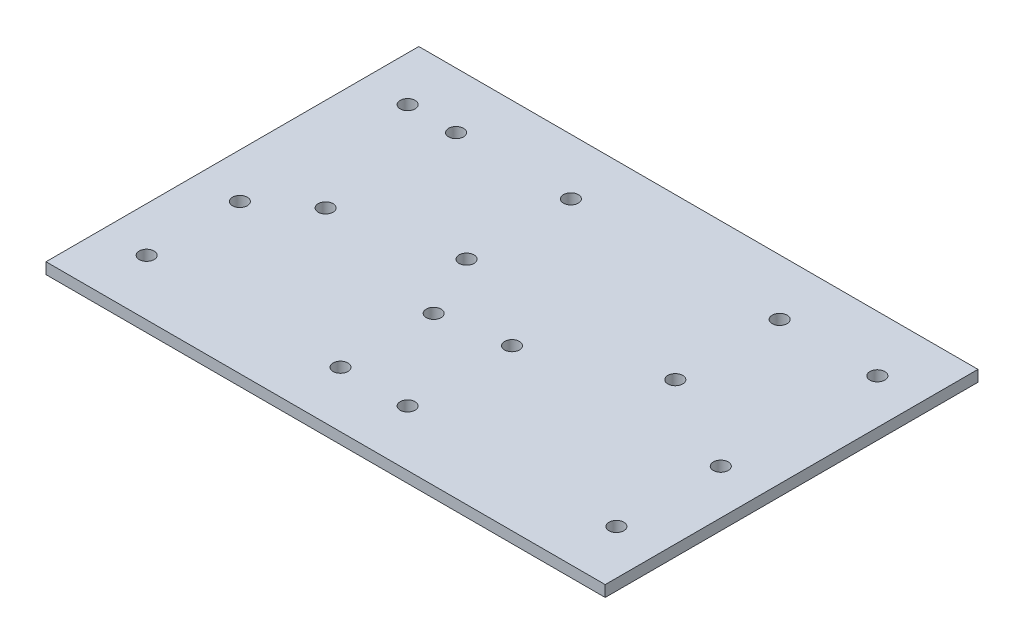
ISO-10303-21;
HEADER;
FILE_DESCRIPTION(('STEP AP214'),'2;1');
FILE_NAME('part.step','',(''),(''),'','','');
FILE_SCHEMA(('AUTOMOTIVE_DESIGN { 1 0 10303 214 1 1 1 1 }'));
ENDSEC;
DATA;
#1=APPLICATION_CONTEXT('core data for automotive mechanical design processes');
#2=APPLICATION_PROTOCOL_DEFINITION('international standard','automotive_design',2000,#1);
#3=PRODUCT_CONTEXT('',#1,'mechanical');
#4=PRODUCT('Part','Part','',(#3));
#5=PRODUCT_RELATED_PRODUCT_CATEGORY('part','',(#4));
#6=PRODUCT_DEFINITION_FORMATION('','',#4);
#7=PRODUCT_DEFINITION_CONTEXT('part definition',#1,'design');
#8=PRODUCT_DEFINITION('design','',#6,#7);
#9=PRODUCT_DEFINITION_SHAPE('','',#8);
#10=(LENGTH_UNIT() NAMED_UNIT(*) SI_UNIT(.MILLI.,.METRE.));
#11=(NAMED_UNIT(*) PLANE_ANGLE_UNIT() SI_UNIT($,.RADIAN.));
#12=(NAMED_UNIT(*) SI_UNIT($,.STERADIAN.) SOLID_ANGLE_UNIT());
#13=UNCERTAINTY_MEASURE_WITH_UNIT(LENGTH_MEASURE(1.E-05),#10,'distance_accuracy_value','');
#14=(GEOMETRIC_REPRESENTATION_CONTEXT(3) GLOBAL_UNCERTAINTY_ASSIGNED_CONTEXT((#13)) GLOBAL_UNIT_ASSIGNED_CONTEXT((#10,
#11,#12)) REPRESENTATION_CONTEXT('',''));
#15=CARTESIAN_POINT('',(0.,0.,0.));
#16=DIRECTION('',(0.,0.,1.));
#17=DIRECTION('',(1.,0.,0.));
#18=AXIS2_PLACEMENT_3D('',#15,#16,#17);
#19=CARTESIAN_POINT('',(0.,3.,0.));
#20=DIRECTION('',(0.,1.,0.));
#21=DIRECTION('',(0.,0.,1.));
#22=AXIS2_PLACEMENT_3D('',#19,#20,#21);
#23=PLANE('',#22);
#24=CARTESIAN_POINT('',(52.,3.,72.5027201008601));
#25=DIRECTION('',(0.,1.,0.));
#26=DIRECTION('',(0.,0.,1.));
#27=AXIS2_PLACEMENT_3D('',#24,#25,#26);
#28=CIRCLE('',#27,2.);
#29=CARTESIAN_POINT('',(52.,3.,74.5027201008601));
#30=VERTEX_POINT('',#29);
#31=EDGE_CURVE('E167',#30,#30,#28,.T.);
#32=ORIENTED_EDGE('',*,*,#31,.F.);
#33=EDGE_LOOP('',(#32));
#34=FACE_BOUND('',#33,.T.);
#35=CARTESIAN_POINT('',(43.8002325240294,3.,2.50272010086011));
#36=DIRECTION('',(0.,1.,0.));
#37=DIRECTION('',(0.,0.,1.));
#38=AXIS2_PLACEMENT_3D('',#35,#36,#37);
#39=CIRCLE('',#38,2.);
#40=CARTESIAN_POINT('',(43.8002325240294,3.,4.50272010086011));
#41=VERTEX_POINT('',#40);
#42=EDGE_CURVE('E160',#41,#41,#39,.T.);
#43=ORIENTED_EDGE('',*,*,#42,.F.);
#44=EDGE_LOOP('',(#43));
#45=FACE_BOUND('',#44,.T.);
#46=CARTESIAN_POINT('',(43.8002325240294,3.,30.5027201008601));
#47=DIRECTION('',(0.,1.,0.));
#48=DIRECTION('',(0.,0.,1.));
#49=AXIS2_PLACEMENT_3D('',#46,#47,#48);
#50=CIRCLE('',#49,2.);
#51=CARTESIAN_POINT('',(43.8002325240294,3.,32.5027201008601));
#52=VERTEX_POINT('',#51);
#53=EDGE_CURVE('E179',#52,#52,#50,.T.);
#54=ORIENTED_EDGE('',*,*,#53,.F.);
#55=EDGE_LOOP('',(#54));
#56=FACE_BOUND('',#55,.T.);
#57=CARTESIAN_POINT('',(99.8002325240294,3.,2.50272010086011));
#58=DIRECTION('',(0.,1.,0.));
#59=DIRECTION('',(0.,0.,1.));
#60=AXIS2_PLACEMENT_3D('',#57,#58,#59);
#61=CIRCLE('',#60,2.);
#62=CARTESIAN_POINT('',(99.8002325240294,3.,4.5027201008601));
#63=VERTEX_POINT('',#62);
#64=EDGE_CURVE('E172',#63,#63,#61,.T.);
#65=ORIENTED_EDGE('',*,*,#64,.F.);
#66=EDGE_LOOP('',(#65));
#67=FACE_BOUND('',#66,.T.);
#68=CARTESIAN_POINT('',(13.,3.,37.5027201008601));
#69=DIRECTION('',(0.,1.,0.));
#70=DIRECTION('',(0.,0.,1.));
#71=AXIS2_PLACEMENT_3D('',#68,#69,#70);
#72=CIRCLE('',#71,2.);
#73=CARTESIAN_POINT('',(13.,3.,39.5027201008601));
#74=VERTEX_POINT('',#73);
#75=EDGE_CURVE('E149',#74,#74,#72,.T.);
#76=ORIENTED_EDGE('',*,*,#75,.F.);
#77=EDGE_LOOP('',(#76));
#78=FACE_BOUND('',#77,.T.);
#79=CARTESIAN_POINT('',(0.,3.,47.5027201008601));
#80=DIRECTION('',(0.,1.,0.));
#81=DIRECTION('',(0.,0.,1.));
#82=AXIS2_PLACEMENT_3D('',#79,#80,#81);
#83=CIRCLE('',#82,2.);
#84=CARTESIAN_POINT('',(0.,3.,49.5027201008601));
#85=VERTEX_POINT('',#84);
#86=EDGE_CURVE('E142',#85,#85,#83,.T.);
#87=ORIENTED_EDGE('',*,*,#86,.F.);
#88=EDGE_LOOP('',(#87));
#89=FACE_BOUND('',#88,.T.);
#90=CARTESIAN_POINT('',(52.,3.,47.5027201008601));
#91=DIRECTION('',(0.,1.,0.));
#92=DIRECTION('',(0.,0.,1.));
#93=AXIS2_PLACEMENT_3D('',#90,#91,#92);
#94=CIRCLE('',#93,2.);
#95=CARTESIAN_POINT('',(52.,3.,49.5027201008601));
#96=VERTEX_POINT('',#95);
#97=EDGE_CURVE('E154',#96,#96,#94,.T.);
#98=ORIENTED_EDGE('',*,*,#97,.F.);
#99=EDGE_LOOP('',(#98));
#100=FACE_BOUND('',#99,.T.);
#101=CARTESIAN_POINT('',(126.,3.,44.5027201008601));
#102=DIRECTION('',(0.,1.,0.));
#103=DIRECTION('',(0.,0.,1.));
#104=AXIS2_PLACEMENT_3D('',#101,#102,#103);
#105=CIRCLE('',#104,2.);
#106=CARTESIAN_POINT('',(126.,3.,46.5027201008601));
#107=VERTEX_POINT('',#106);
#108=EDGE_CURVE('E196',#107,#107,#105,.T.);
#109=ORIENTED_EDGE('',*,*,#108,.F.);
#110=EDGE_LOOP('',(#109));
#111=FACE_BOUND('',#110,.T.);
#112=CARTESIAN_POINT('',(70.,3.,72.5027201008601));
#113=DIRECTION('',(0.,1.,0.));
#114=DIRECTION('',(0.,0.,1.));
#115=AXIS2_PLACEMENT_3D('',#112,#113,#114);
#116=CIRCLE('',#115,2.);
#117=CARTESIAN_POINT('',(70.,3.,74.5027201008601));
#118=VERTEX_POINT('',#117);
#119=EDGE_CURVE('E202',#118,#118,#116,.T.);
#120=ORIENTED_EDGE('',*,*,#119,.F.);
#121=EDGE_LOOP('',(#120));
#122=FACE_BOUND('',#121,.T.);
#123=CARTESIAN_POINT('',(70.,3.,44.5027201008601));
#124=DIRECTION('',(0.,1.,0.));
#125=DIRECTION('',(0.,0.,1.));
#126=AXIS2_PLACEMENT_3D('',#123,#124,#125);
#127=CIRCLE('',#126,2.);
#128=CARTESIAN_POINT('',(70.,3.,46.5027201008601));
#129=VERTEX_POINT('',#128);
#130=EDGE_CURVE('E184',#129,#129,#127,.T.);
#131=ORIENTED_EDGE('',*,*,#130,.F.);
#132=EDGE_LOOP('',(#131));
#133=FACE_BOUND('',#132,.T.);
#134=CARTESIAN_POINT('',(99.8002325240294,3.,30.5027201008601));
#135=DIRECTION('',(0.,1.,0.));
#136=DIRECTION('',(0.,0.,1.));
#137=AXIS2_PLACEMENT_3D('',#134,#135,#136);
#138=CIRCLE('',#137,2.);
#139=CARTESIAN_POINT('',(99.8002325240294,3.,32.5027201008601));
#140=VERTEX_POINT('',#139);
#141=EDGE_CURVE('E191',#140,#140,#138,.T.);
#142=ORIENTED_EDGE('',*,*,#141,.F.);
#143=EDGE_LOOP('',(#142));
#144=FACE_BOUND('',#143,.T.);
#145=CARTESIAN_POINT('',(13.,3.,2.50272010086011));
#146=DIRECTION('',(0.,1.,0.));
#147=DIRECTION('',(0.,0.,1.));
#148=AXIS2_PLACEMENT_3D('',#145,#146,#147);
#149=CIRCLE('',#148,2.);
#150=CARTESIAN_POINT('',(13.,3.,4.50272010086011));
#151=VERTEX_POINT('',#150);
#152=EDGE_CURVE('E136',#151,#151,#149,.T.);
#153=ORIENTED_EDGE('',*,*,#152,.F.);
#154=EDGE_LOOP('',(#153));
#155=FACE_BOUND('',#154,.T.);
#156=CARTESIAN_POINT('',(0.,3.,72.5027201008601));
#157=DIRECTION('',(0.,1.,0.));
#158=DIRECTION('',(0.,0.,1.));
#159=AXIS2_PLACEMENT_3D('',#156,#157,#158);
#160=CIRCLE('',#159,2.);
#161=CARTESIAN_POINT('',(0.,3.,74.5027201008601));
#162=VERTEX_POINT('',#161);
#163=EDGE_CURVE('E121',#162,#162,#160,.T.);
#164=ORIENTED_EDGE('',*,*,#163,.F.);
#165=EDGE_LOOP('',(#164));
#166=FACE_BOUND('',#165,.T.);
#167=CARTESIAN_POINT('',(0.,3.,2.50272010086011));
#168=DIRECTION('',(0.,1.,0.));
#169=DIRECTION('',(0.,0.,1.));
#170=AXIS2_PLACEMENT_3D('',#167,#168,#169);
#171=CIRCLE('',#170,2.);
#172=CARTESIAN_POINT('',(0.,3.,4.50272010086011));
#173=VERTEX_POINT('',#172);
#174=EDGE_CURVE('E100',#173,#173,#171,.T.);
#175=ORIENTED_EDGE('',*,*,#174,.F.);
#176=EDGE_LOOP('',(#175));
#177=FACE_BOUND('',#176,.T.);
#178=DIRECTION('',(0.,0.,1.));
#179=VECTOR('',#178,1.);
#180=CARTESIAN_POINT('',(-12.,3.,-12.4972798991399));
#181=LINE('',#180,#179);
#182=CARTESIAN_POINT('',(-12.,3.,-12.4972798991399));
#183=VERTEX_POINT('',#182);
#184=CARTESIAN_POINT('',(-12.,3.,87.5027201008601));
#185=VERTEX_POINT('',#184);
#186=EDGE_CURVE('E85',#183,#185,#181,.T.);
#187=ORIENTED_EDGE('',*,*,#186,.T.);
#188=DIRECTION('',(1.,0.,0.));
#189=VECTOR('',#188,1.);
#190=CARTESIAN_POINT('',(-12.,3.,87.5027201008601));
#191=LINE('',#190,#189);
#192=CARTESIAN_POINT('',(138.,3.,87.5027201008601));
#193=VERTEX_POINT('',#192);
#194=EDGE_CURVE('E80',#185,#193,#191,.T.);
#195=ORIENTED_EDGE('',*,*,#194,.T.);
#196=DIRECTION('',(0.,0.,-1.));
#197=VECTOR('',#196,1.);
#198=CARTESIAN_POINT('',(138.,3.,-12.4972798991399));
#199=LINE('',#198,#197);
#200=CARTESIAN_POINT('',(138.,3.,-12.4972798991399));
#201=VERTEX_POINT('',#200);
#202=EDGE_CURVE('E83',#193,#201,#199,.T.);
#203=ORIENTED_EDGE('',*,*,#202,.T.);
#204=DIRECTION('',(-1.,0.,0.));
#205=VECTOR('',#204,1.);
#206=CARTESIAN_POINT('',(-12.,3.,-12.4972798991399));
#207=LINE('',#206,#205);
#208=EDGE_CURVE('E50',#201,#183,#207,.T.);
#209=ORIENTED_EDGE('',*,*,#208,.T.);
#210=EDGE_LOOP('',(#187,#195,#203,#209));
#211=FACE_BOUND('',#210,.T.);
#212=CARTESIAN_POINT('',(126.,3.,2.50272010086011));
#213=DIRECTION('',(0.,1.,0.));
#214=DIRECTION('',(0.,0.,1.));
#215=AXIS2_PLACEMENT_3D('',#212,#213,#214);
#216=CIRCLE('',#215,2.);
#217=CARTESIAN_POINT('',(126.,3.,4.5027201008601));
#218=VERTEX_POINT('',#217);
#219=EDGE_CURVE('E115',#218,#218,#216,.T.);
#220=ORIENTED_EDGE('',*,*,#219,.F.);
#221=EDGE_LOOP('',(#220));
#222=FACE_BOUND('',#221,.T.);
#223=CARTESIAN_POINT('',(126.,3.,72.5027201008601));
#224=DIRECTION('',(0.,1.,0.));
#225=DIRECTION('',(0.,0.,1.));
#226=AXIS2_PLACEMENT_3D('',#223,#224,#225);
#227=CIRCLE('',#226,2.);
#228=CARTESIAN_POINT('',(126.,3.,74.5027201008601));
#229=VERTEX_POINT('',#228);
#230=EDGE_CURVE('E127',#229,#229,#227,.T.);
#231=ORIENTED_EDGE('',*,*,#230,.F.);
#232=EDGE_LOOP('',(#231));
#233=FACE_BOUND('',#232,.T.);
#234=ADVANCED_FACE('F33',(#34,#45,#56,#67,#78,#89,#100,#111,#122,#133,#144,#155,#166,#177,#211,
#222,#233),#23,.T.);
#235=CARTESIAN_POINT('',(0.,0.,0.));
#236=DIRECTION('',(0.,1.,0.));
#237=DIRECTION('',(0.,0.,1.));
#238=AXIS2_PLACEMENT_3D('',#235,#236,#237);
#239=PLANE('',#238);
#240=CARTESIAN_POINT('',(52.,0.,72.5027201008601));
#241=DIRECTION('',(0.,1.,0.));
#242=DIRECTION('',(0.,0.,1.));
#243=AXIS2_PLACEMENT_3D('',#240,#241,#242);
#244=CIRCLE('',#243,2.);
#245=CARTESIAN_POINT('',(52.,0.,74.5027201008601));
#246=VERTEX_POINT('',#245);
#247=EDGE_CURVE('E157',#246,#246,#244,.T.);
#248=ORIENTED_EDGE('',*,*,#247,.T.);
#249=EDGE_LOOP('',(#248));
#250=FACE_BOUND('',#249,.T.);
#251=CARTESIAN_POINT('',(43.8002325240294,0.,2.50272010086011));
#252=DIRECTION('',(0.,1.,0.));
#253=DIRECTION('',(0.,0.,1.));
#254=AXIS2_PLACEMENT_3D('',#251,#252,#253);
#255=CIRCLE('',#254,2.);
#256=CARTESIAN_POINT('',(43.8002325240294,0.,4.50272010086011));
#257=VERTEX_POINT('',#256);
#258=EDGE_CURVE('E163',#257,#257,#255,.T.);
#259=ORIENTED_EDGE('',*,*,#258,.T.);
#260=EDGE_LOOP('',(#259));
#261=FACE_BOUND('',#260,.T.);
#262=CARTESIAN_POINT('',(43.8002325240294,0.,30.5027201008601));
#263=DIRECTION('',(0.,1.,0.));
#264=DIRECTION('',(0.,0.,1.));
#265=AXIS2_PLACEMENT_3D('',#262,#263,#264);
#266=CIRCLE('',#265,2.);
#267=CARTESIAN_POINT('',(43.8002325240294,0.,32.5027201008601));
#268=VERTEX_POINT('',#267);
#269=EDGE_CURVE('E164',#268,#268,#266,.T.);
#270=ORIENTED_EDGE('',*,*,#269,.T.);
#271=EDGE_LOOP('',(#270));
#272=FACE_BOUND('',#271,.T.);
#273=CARTESIAN_POINT('',(99.8002325240294,0.,2.50272010086011));
#274=DIRECTION('',(0.,1.,0.));
#275=DIRECTION('',(0.,0.,1.));
#276=AXIS2_PLACEMENT_3D('',#273,#274,#275);
#277=CIRCLE('',#276,2.);
#278=CARTESIAN_POINT('',(99.8002325240294,0.,4.5027201008601));
#279=VERTEX_POINT('',#278);
#280=EDGE_CURVE('E175',#279,#279,#277,.T.);
#281=ORIENTED_EDGE('',*,*,#280,.T.);
#282=EDGE_LOOP('',(#281));
#283=FACE_BOUND('',#282,.T.);
#284=CARTESIAN_POINT('',(13.,0.,37.5027201008601));
#285=DIRECTION('',(0.,1.,0.));
#286=DIRECTION('',(0.,0.,1.));
#287=AXIS2_PLACEMENT_3D('',#284,#285,#286);
#288=CIRCLE('',#287,2.);
#289=CARTESIAN_POINT('',(13.,0.,39.5027201008601));
#290=VERTEX_POINT('',#289);
#291=EDGE_CURVE('E139',#290,#290,#288,.T.);
#292=ORIENTED_EDGE('',*,*,#291,.T.);
#293=EDGE_LOOP('',(#292));
#294=FACE_BOUND('',#293,.T.);
#295=CARTESIAN_POINT('',(0.,0.,47.5027201008601));
#296=DIRECTION('',(0.,1.,0.));
#297=DIRECTION('',(0.,0.,1.));
#298=AXIS2_PLACEMENT_3D('',#295,#296,#297);
#299=CIRCLE('',#298,2.);
#300=CARTESIAN_POINT('',(0.,0.,49.5027201008601));
#301=VERTEX_POINT('',#300);
#302=EDGE_CURVE('E145',#301,#301,#299,.T.);
#303=ORIENTED_EDGE('',*,*,#302,.T.);
#304=EDGE_LOOP('',(#303));
#305=FACE_BOUND('',#304,.T.);
#306=CARTESIAN_POINT('',(52.,0.,47.5027201008601));
#307=DIRECTION('',(0.,1.,0.));
#308=DIRECTION('',(0.,0.,1.));
#309=AXIS2_PLACEMENT_3D('',#306,#307,#308);
#310=CIRCLE('',#309,2.);
#311=CARTESIAN_POINT('',(52.,0.,49.5027201008601));
#312=VERTEX_POINT('',#311);
#313=EDGE_CURVE('E146',#312,#312,#310,.T.);
#314=ORIENTED_EDGE('',*,*,#313,.T.);
#315=EDGE_LOOP('',(#314));
#316=FACE_BOUND('',#315,.T.);
#317=CARTESIAN_POINT('',(126.,0.,44.5027201008601));
#318=DIRECTION('',(0.,1.,0.));
#319=DIRECTION('',(0.,0.,1.));
#320=AXIS2_PLACEMENT_3D('',#317,#318,#319);
#321=CIRCLE('',#320,2.);
#322=CARTESIAN_POINT('',(126.,0.,46.5027201008601));
#323=VERTEX_POINT('',#322);
#324=EDGE_CURVE('E199',#323,#323,#321,.T.);
#325=ORIENTED_EDGE('',*,*,#324,.T.);
#326=EDGE_LOOP('',(#325));
#327=FACE_BOUND('',#326,.T.);
#328=CARTESIAN_POINT('',(70.,0.,72.5027201008601));
#329=DIRECTION('',(0.,1.,0.));
#330=DIRECTION('',(0.,0.,1.));
#331=AXIS2_PLACEMENT_3D('',#328,#329,#330);
#332=CIRCLE('',#331,2.);
#333=CARTESIAN_POINT('',(70.,0.,74.5027201008601));
#334=VERTEX_POINT('',#333);
#335=EDGE_CURVE('E188',#334,#334,#332,.T.);
#336=ORIENTED_EDGE('',*,*,#335,.T.);
#337=EDGE_LOOP('',(#336));
#338=FACE_BOUND('',#337,.T.);
#339=CARTESIAN_POINT('',(70.,0.,44.5027201008601));
#340=DIRECTION('',(0.,1.,0.));
#341=DIRECTION('',(0.,0.,1.));
#342=AXIS2_PLACEMENT_3D('',#339,#340,#341);
#343=CIRCLE('',#342,2.);
#344=CARTESIAN_POINT('',(70.,0.,46.5027201008601));
#345=VERTEX_POINT('',#344);
#346=EDGE_CURVE('E187',#345,#345,#343,.T.);
#347=ORIENTED_EDGE('',*,*,#346,.T.);
#348=EDGE_LOOP('',(#347));
#349=FACE_BOUND('',#348,.T.);
#350=CARTESIAN_POINT('',(99.8002325240294,0.,30.5027201008601));
#351=DIRECTION('',(0.,1.,0.));
#352=DIRECTION('',(0.,0.,1.));
#353=AXIS2_PLACEMENT_3D('',#350,#351,#352);
#354=CIRCLE('',#353,2.);
#355=CARTESIAN_POINT('',(99.8002325240294,0.,32.5027201008601));
#356=VERTEX_POINT('',#355);
#357=EDGE_CURVE('E176',#356,#356,#354,.T.);
#358=ORIENTED_EDGE('',*,*,#357,.T.);
#359=EDGE_LOOP('',(#358));
#360=FACE_BOUND('',#359,.T.);
#361=CARTESIAN_POINT('',(13.,0.,2.50272010086011));
#362=DIRECTION('',(0.,1.,0.));
#363=DIRECTION('',(0.,0.,1.));
#364=AXIS2_PLACEMENT_3D('',#361,#362,#363);
#365=CIRCLE('',#364,2.);
#366=CARTESIAN_POINT('',(13.,0.,4.50272010086011));
#367=VERTEX_POINT('',#366);
#368=EDGE_CURVE('E133',#367,#367,#365,.T.);
#369=ORIENTED_EDGE('',*,*,#368,.T.);
#370=EDGE_LOOP('',(#369));
#371=FACE_BOUND('',#370,.T.);
#372=DIRECTION('',(0.,0.,1.));
#373=VECTOR('',#372,1.);
#374=CARTESIAN_POINT('',(-12.,0.,-12.4972798991399));
#375=LINE('',#374,#373);
#376=CARTESIAN_POINT('',(-12.,0.,-12.4972798991399));
#377=VERTEX_POINT('',#376);
#378=CARTESIAN_POINT('',(-12.,0.,87.5027201008601));
#379=VERTEX_POINT('',#378);
#380=EDGE_CURVE('E97',#377,#379,#375,.T.);
#381=ORIENTED_EDGE('',*,*,#380,.F.);
#382=DIRECTION('',(-1.,0.,0.));
#383=VECTOR('',#382,1.);
#384=CARTESIAN_POINT('',(-12.,0.,-12.4972798991399));
#385=LINE('',#384,#383);
#386=CARTESIAN_POINT('',(138.,0.,-12.4972798991399));
#387=VERTEX_POINT('',#386);
#388=EDGE_CURVE('E73',#387,#377,#385,.T.);
#389=ORIENTED_EDGE('',*,*,#388,.F.);
#390=DIRECTION('',(0.,0.,-1.));
#391=VECTOR('',#390,1.);
#392=CARTESIAN_POINT('',(138.,0.,-12.4972798991399));
#393=LINE('',#392,#391);
#394=CARTESIAN_POINT('',(138.,0.,87.5027201008601));
#395=VERTEX_POINT('',#394);
#396=EDGE_CURVE('E67',#395,#387,#393,.T.);
#397=ORIENTED_EDGE('',*,*,#396,.F.);
#398=DIRECTION('',(1.,0.,0.));
#399=VECTOR('',#398,1.);
#400=CARTESIAN_POINT('',(-12.,0.,87.5027201008601));
#401=LINE('',#400,#399);
#402=EDGE_CURVE('E89',#379,#395,#401,.T.);
#403=ORIENTED_EDGE('',*,*,#402,.F.);
#404=EDGE_LOOP('',(#381,#389,#397,#403));
#405=FACE_BOUND('',#404,.T.);
#406=CARTESIAN_POINT('',(0.,0.,2.50272010086011));
#407=DIRECTION('',(0.,1.,0.));
#408=DIRECTION('',(0.,0.,1.));
#409=AXIS2_PLACEMENT_3D('',#406,#407,#408);
#410=CIRCLE('',#409,2.);
#411=CARTESIAN_POINT('',(0.,0.,4.50272010086011));
#412=VERTEX_POINT('',#411);
#413=EDGE_CURVE('E112',#412,#412,#410,.T.);
#414=ORIENTED_EDGE('',*,*,#413,.T.);
#415=EDGE_LOOP('',(#414));
#416=FACE_BOUND('',#415,.T.);
#417=CARTESIAN_POINT('',(126.,0.,2.50272010086011));
#418=DIRECTION('',(0.,1.,0.));
#419=DIRECTION('',(0.,0.,1.));
#420=AXIS2_PLACEMENT_3D('',#417,#418,#419);
#421=CIRCLE('',#420,2.);
#422=CARTESIAN_POINT('',(126.,0.,4.5027201008601));
#423=VERTEX_POINT('',#422);
#424=EDGE_CURVE('E118',#423,#423,#421,.T.);
#425=ORIENTED_EDGE('',*,*,#424,.T.);
#426=EDGE_LOOP('',(#425));
#427=FACE_BOUND('',#426,.T.);
#428=CARTESIAN_POINT('',(0.,0.,72.5027201008601));
#429=DIRECTION('',(0.,1.,0.));
#430=DIRECTION('',(0.,0.,1.));
#431=AXIS2_PLACEMENT_3D('',#428,#429,#430);
#432=CIRCLE('',#431,2.);
#433=CARTESIAN_POINT('',(0.,0.,74.5027201008601));
#434=VERTEX_POINT('',#433);
#435=EDGE_CURVE('E124',#434,#434,#432,.T.);
#436=ORIENTED_EDGE('',*,*,#435,.T.);
#437=EDGE_LOOP('',(#436));
#438=FACE_BOUND('',#437,.T.);
#439=CARTESIAN_POINT('',(126.,0.,72.5027201008601));
#440=DIRECTION('',(0.,1.,0.));
#441=DIRECTION('',(0.,0.,1.));
#442=AXIS2_PLACEMENT_3D('',#439,#440,#441);
#443=CIRCLE('',#442,2.);
#444=CARTESIAN_POINT('',(126.,0.,74.5027201008601));
#445=VERTEX_POINT('',#444);
#446=EDGE_CURVE('E130',#445,#445,#443,.T.);
#447=ORIENTED_EDGE('',*,*,#446,.T.);
#448=EDGE_LOOP('',(#447));
#449=FACE_BOUND('',#448,.T.);
#450=ADVANCED_FACE('F108',(#250,#261,#272,#283,#294,#305,#316,#327,#338,#349,#360,#371,#405,
#416,#427,#438,#449),#239,.F.);
#451=CARTESIAN_POINT('',(-12.,3.,-12.4972798991399));
#452=DIRECTION('',(1.,0.,0.));
#453=DIRECTION('',(0.,0.,-1.));
#454=AXIS2_PLACEMENT_3D('',#451,#452,#453);
#455=PLANE('',#454);
#456=ORIENTED_EDGE('',*,*,#380,.T.);
#457=DIRECTION('',(0.,-1.,0.));
#458=VECTOR('',#457,1.);
#459=CARTESIAN_POINT('',(-12.,3.,87.5027201008601));
#460=LINE('',#459,#458);
#461=EDGE_CURVE('E11',#185,#379,#460,.T.);
#462=ORIENTED_EDGE('',*,*,#461,.F.);
#463=ORIENTED_EDGE('',*,*,#186,.F.);
#464=DIRECTION('',(0.,-1.,0.));
#465=VECTOR('',#464,1.);
#466=CARTESIAN_POINT('',(-12.,3.,-12.4972798991399));
#467=LINE('',#466,#465);
#468=EDGE_CURVE('E93',#183,#377,#467,.T.);
#469=ORIENTED_EDGE('',*,*,#468,.T.);
#470=EDGE_LOOP('',(#456,#462,#463,#469));
#471=FACE_BOUND('',#470,.T.);
#472=ADVANCED_FACE('F35',(#471),#455,.F.);
#473=CARTESIAN_POINT('',(-12.,3.,87.5027201008601));
#474=DIRECTION('',(0.,0.,-1.));
#475=DIRECTION('',(-1.,0.,0.));
#476=AXIS2_PLACEMENT_3D('',#473,#474,#475);
#477=PLANE('',#476);
#478=ORIENTED_EDGE('',*,*,#402,.T.);
#479=DIRECTION('',(0.,-1.,0.));
#480=VECTOR('',#479,1.);
#481=CARTESIAN_POINT('',(138.,3.,87.5027201008601));
#482=LINE('',#481,#480);
#483=EDGE_CURVE('E42',#193,#395,#482,.T.);
#484=ORIENTED_EDGE('',*,*,#483,.F.);
#485=ORIENTED_EDGE('',*,*,#194,.F.);
#486=ORIENTED_EDGE('',*,*,#461,.T.);
#487=EDGE_LOOP('',(#478,#484,#485,#486));
#488=FACE_BOUND('',#487,.T.);
#489=ADVANCED_FACE('F88',(#488),#477,.F.);
#490=CARTESIAN_POINT('',(138.,3.,-12.4972798991399));
#491=DIRECTION('',(-1.,0.,0.));
#492=DIRECTION('',(0.,0.,1.));
#493=AXIS2_PLACEMENT_3D('',#490,#491,#492);
#494=PLANE('',#493);
#495=ORIENTED_EDGE('',*,*,#396,.T.);
#496=DIRECTION('',(0.,-1.,0.));
#497=VECTOR('',#496,1.);
#498=CARTESIAN_POINT('',(138.,3.,-12.4972798991399));
#499=LINE('',#498,#497);
#500=EDGE_CURVE('E90',#201,#387,#499,.T.);
#501=ORIENTED_EDGE('',*,*,#500,.F.);
#502=ORIENTED_EDGE('',*,*,#202,.F.);
#503=ORIENTED_EDGE('',*,*,#483,.T.);
#504=EDGE_LOOP('',(#495,#501,#502,#503));
#505=FACE_BOUND('',#504,.T.);
#506=ADVANCED_FACE('F91',(#505),#494,.F.);
#507=CARTESIAN_POINT('',(-12.,3.,-12.4972798991399));
#508=DIRECTION('',(0.,0.,1.));
#509=DIRECTION('',(1.,0.,0.));
#510=AXIS2_PLACEMENT_3D('',#507,#508,#509);
#511=PLANE('',#510);
#512=ORIENTED_EDGE('',*,*,#388,.T.);
#513=ORIENTED_EDGE('',*,*,#468,.F.);
#514=ORIENTED_EDGE('',*,*,#208,.F.);
#515=ORIENTED_EDGE('',*,*,#500,.T.);
#516=EDGE_LOOP('',(#512,#513,#514,#515));
#517=FACE_BOUND('',#516,.T.);
#518=ADVANCED_FACE('F105',(#517),#511,.F.);
#519=CARTESIAN_POINT('',(0.,3.,2.50272010086011));
#520=DIRECTION('',(0.,-1.,0.));
#521=DIRECTION('',(0.,0.,-1.));
#522=AXIS2_PLACEMENT_3D('',#519,#520,#521);
#523=CYLINDRICAL_SURFACE('',#522,2.);
#524=ORIENTED_EDGE('',*,*,#174,.T.);
#525=EDGE_LOOP('',(#524));
#526=FACE_BOUND('',#525,.T.);
#527=ORIENTED_EDGE('',*,*,#413,.F.);
#528=EDGE_LOOP('',(#527));
#529=FACE_BOUND('',#528,.T.);
#530=ADVANCED_FACE('F232',(#526,#529),#523,.F.);
#531=CARTESIAN_POINT('',(126.,3.,2.50272010086011));
#532=DIRECTION('',(0.,-1.,0.));
#533=DIRECTION('',(0.,0.,-1.));
#534=AXIS2_PLACEMENT_3D('',#531,#532,#533);
#535=CYLINDRICAL_SURFACE('',#534,2.);
#536=ORIENTED_EDGE('',*,*,#219,.T.);
#537=EDGE_LOOP('',(#536));
#538=FACE_BOUND('',#537,.T.);
#539=ORIENTED_EDGE('',*,*,#424,.F.);
#540=EDGE_LOOP('',(#539));
#541=FACE_BOUND('',#540,.T.);
#542=ADVANCED_FACE('F235',(#538,#541),#535,.F.);
#543=CARTESIAN_POINT('',(0.,3.,72.5027201008601));
#544=DIRECTION('',(0.,-1.,0.));
#545=DIRECTION('',(0.,0.,-1.));
#546=AXIS2_PLACEMENT_3D('',#543,#544,#545);
#547=CYLINDRICAL_SURFACE('',#546,2.);
#548=ORIENTED_EDGE('',*,*,#163,.T.);
#549=EDGE_LOOP('',(#548));
#550=FACE_BOUND('',#549,.T.);
#551=ORIENTED_EDGE('',*,*,#435,.F.);
#552=EDGE_LOOP('',(#551));
#553=FACE_BOUND('',#552,.T.);
#554=ADVANCED_FACE('F251',(#550,#553),#547,.F.);
#555=CARTESIAN_POINT('',(126.,3.,72.5027201008601));
#556=DIRECTION('',(0.,-1.,0.));
#557=DIRECTION('',(0.,0.,-1.));
#558=AXIS2_PLACEMENT_3D('',#555,#556,#557);
#559=CYLINDRICAL_SURFACE('',#558,2.);
#560=ORIENTED_EDGE('',*,*,#230,.T.);
#561=EDGE_LOOP('',(#560));
#562=FACE_BOUND('',#561,.T.);
#563=ORIENTED_EDGE('',*,*,#446,.F.);
#564=EDGE_LOOP('',(#563));
#565=FACE_BOUND('',#564,.T.);
#566=ADVANCED_FACE('F248',(#562,#565),#559,.F.);
#567=CARTESIAN_POINT('',(13.,0.,2.50272010086011));
#568=DIRECTION('',(0.,1.,0.));
#569=DIRECTION('',(0.,0.,1.));
#570=AXIS2_PLACEMENT_3D('',#567,#568,#569);
#571=CYLINDRICAL_SURFACE('',#570,2.);
#572=ORIENTED_EDGE('',*,*,#368,.F.);
#573=EDGE_LOOP('',(#572));
#574=FACE_BOUND('',#573,.T.);
#575=ORIENTED_EDGE('',*,*,#152,.T.);
#576=EDGE_LOOP('',(#575));
#577=FACE_BOUND('',#576,.T.);
#578=ADVANCED_FACE('F250',(#574,#577),#571,.F.);
#579=CARTESIAN_POINT('',(99.8002325240294,0.,30.5027201008601));
#580=DIRECTION('',(0.,1.,0.));
#581=DIRECTION('',(0.,0.,1.));
#582=AXIS2_PLACEMENT_3D('',#579,#580,#581);
#583=CYLINDRICAL_SURFACE('',#582,2.);
#584=ORIENTED_EDGE('',*,*,#357,.F.);
#585=EDGE_LOOP('',(#584));
#586=FACE_BOUND('',#585,.T.);
#587=ORIENTED_EDGE('',*,*,#141,.T.);
#588=EDGE_LOOP('',(#587));
#589=FACE_BOUND('',#588,.T.);
#590=ADVANCED_FACE('F258',(#586,#589),#583,.F.);
#591=CARTESIAN_POINT('',(70.,0.,44.5027201008601));
#592=DIRECTION('',(0.,1.,0.));
#593=DIRECTION('',(0.,0.,1.));
#594=AXIS2_PLACEMENT_3D('',#591,#592,#593);
#595=CYLINDRICAL_SURFACE('',#594,2.);
#596=ORIENTED_EDGE('',*,*,#346,.F.);
#597=EDGE_LOOP('',(#596));
#598=FACE_BOUND('',#597,.T.);
#599=ORIENTED_EDGE('',*,*,#130,.T.);
#600=EDGE_LOOP('',(#599));
#601=FACE_BOUND('',#600,.T.);
#602=ADVANCED_FACE('F214',(#598,#601),#595,.F.);
#603=CARTESIAN_POINT('',(70.,0.,72.5027201008601));
#604=DIRECTION('',(0.,1.,0.));
#605=DIRECTION('',(0.,0.,1.));
#606=AXIS2_PLACEMENT_3D('',#603,#604,#605);
#607=CYLINDRICAL_SURFACE('',#606,2.);
#608=ORIENTED_EDGE('',*,*,#335,.F.);
#609=EDGE_LOOP('',(#608));
#610=FACE_BOUND('',#609,.T.);
#611=ORIENTED_EDGE('',*,*,#119,.T.);
#612=EDGE_LOOP('',(#611));
#613=FACE_BOUND('',#612,.T.);
#614=ADVANCED_FACE('F210',(#610,#613),#607,.F.);
#615=CARTESIAN_POINT('',(126.,0.,44.5027201008601));
#616=DIRECTION('',(0.,1.,0.));
#617=DIRECTION('',(0.,0.,1.));
#618=AXIS2_PLACEMENT_3D('',#615,#616,#617);
#619=CYLINDRICAL_SURFACE('',#618,2.);
#620=ORIENTED_EDGE('',*,*,#324,.F.);
#621=EDGE_LOOP('',(#620));
#622=FACE_BOUND('',#621,.T.);
#623=ORIENTED_EDGE('',*,*,#108,.T.);
#624=EDGE_LOOP('',(#623));
#625=FACE_BOUND('',#624,.T.);
#626=ADVANCED_FACE('F213',(#622,#625),#619,.F.);
#627=CARTESIAN_POINT('',(52.,0.,47.5027201008601));
#628=DIRECTION('',(0.,1.,0.));
#629=DIRECTION('',(0.,0.,1.));
#630=AXIS2_PLACEMENT_3D('',#627,#628,#629);
#631=CYLINDRICAL_SURFACE('',#630,2.);
#632=ORIENTED_EDGE('',*,*,#313,.F.);
#633=EDGE_LOOP('',(#632));
#634=FACE_BOUND('',#633,.T.);
#635=ORIENTED_EDGE('',*,*,#97,.T.);
#636=EDGE_LOOP('',(#635));
#637=FACE_BOUND('',#636,.T.);
#638=ADVANCED_FACE('F363',(#634,#637),#631,.F.);
#639=CARTESIAN_POINT('',(0.,0.,47.5027201008601));
#640=DIRECTION('',(0.,1.,0.));
#641=DIRECTION('',(0.,0.,1.));
#642=AXIS2_PLACEMENT_3D('',#639,#640,#641);
#643=CYLINDRICAL_SURFACE('',#642,2.);
#644=ORIENTED_EDGE('',*,*,#302,.F.);
#645=EDGE_LOOP('',(#644));
#646=FACE_BOUND('',#645,.T.);
#647=ORIENTED_EDGE('',*,*,#86,.T.);
#648=EDGE_LOOP('',(#647));
#649=FACE_BOUND('',#648,.T.);
#650=ADVANCED_FACE('F372',(#646,#649),#643,.F.);
#651=CARTESIAN_POINT('',(13.,0.,37.5027201008601));
#652=DIRECTION('',(0.,1.,0.));
#653=DIRECTION('',(0.,0.,1.));
#654=AXIS2_PLACEMENT_3D('',#651,#652,#653);
#655=CYLINDRICAL_SURFACE('',#654,2.);
#656=ORIENTED_EDGE('',*,*,#291,.F.);
#657=EDGE_LOOP('',(#656));
#658=FACE_BOUND('',#657,.T.);
#659=ORIENTED_EDGE('',*,*,#75,.T.);
#660=EDGE_LOOP('',(#659));
#661=FACE_BOUND('',#660,.T.);
#662=ADVANCED_FACE('F381',(#658,#661),#655,.F.);
#663=CARTESIAN_POINT('',(99.8002325240294,0.,2.50272010086011));
#664=DIRECTION('',(0.,1.,0.));
#665=DIRECTION('',(0.,0.,1.));
#666=AXIS2_PLACEMENT_3D('',#663,#664,#665);
#667=CYLINDRICAL_SURFACE('',#666,2.);
#668=ORIENTED_EDGE('',*,*,#280,.F.);
#669=EDGE_LOOP('',(#668));
#670=FACE_BOUND('',#669,.T.);
#671=ORIENTED_EDGE('',*,*,#64,.T.);
#672=EDGE_LOOP('',(#671));
#673=FACE_BOUND('',#672,.T.);
#674=ADVANCED_FACE('F389',(#670,#673),#667,.F.);
#675=CARTESIAN_POINT('',(43.8002325240294,0.,30.5027201008601));
#676=DIRECTION('',(0.,1.,0.));
#677=DIRECTION('',(0.,0.,1.));
#678=AXIS2_PLACEMENT_3D('',#675,#676,#677);
#679=CYLINDRICAL_SURFACE('',#678,2.);
#680=ORIENTED_EDGE('',*,*,#269,.F.);
#681=EDGE_LOOP('',(#680));
#682=FACE_BOUND('',#681,.T.);
#683=ORIENTED_EDGE('',*,*,#53,.T.);
#684=EDGE_LOOP('',(#683));
#685=FACE_BOUND('',#684,.T.);
#686=ADVANCED_FACE('F398',(#682,#685),#679,.F.);
#687=CARTESIAN_POINT('',(43.8002325240294,0.,2.50272010086011));
#688=DIRECTION('',(0.,1.,0.));
#689=DIRECTION('',(0.,0.,1.));
#690=AXIS2_PLACEMENT_3D('',#687,#688,#689);
#691=CYLINDRICAL_SURFACE('',#690,2.);
#692=ORIENTED_EDGE('',*,*,#258,.F.);
#693=EDGE_LOOP('',(#692));
#694=FACE_BOUND('',#693,.T.);
#695=ORIENTED_EDGE('',*,*,#42,.T.);
#696=EDGE_LOOP('',(#695));
#697=FACE_BOUND('',#696,.T.);
#698=ADVANCED_FACE('F407',(#694,#697),#691,.F.);
#699=CARTESIAN_POINT('',(52.,0.,72.5027201008601));
#700=DIRECTION('',(0.,1.,0.));
#701=DIRECTION('',(0.,0.,1.));
#702=AXIS2_PLACEMENT_3D('',#699,#700,#701);
#703=CYLINDRICAL_SURFACE('',#702,2.);
#704=ORIENTED_EDGE('',*,*,#247,.F.);
#705=EDGE_LOOP('',(#704));
#706=FACE_BOUND('',#705,.T.);
#707=ORIENTED_EDGE('',*,*,#31,.T.);
#708=EDGE_LOOP('',(#707));
#709=FACE_BOUND('',#708,.T.);
#710=ADVANCED_FACE('F416',(#706,#709),#703,.F.);
#711=CLOSED_SHELL('',(#234,#450,#472,#489,#506,#518,#530,#542,#554,#566,#578,#590,#602,#614,
#626,#638,#650,#662,#674,#686,#698,#710));
#712=MANIFOLD_SOLID_BREP('B2',#711);
#713=ADVANCED_BREP_SHAPE_REPRESENTATION('',(#18,#712),#14);
#714=SHAPE_DEFINITION_REPRESENTATION(#9,#713);
ENDSEC;
END-ISO-10303-21;
